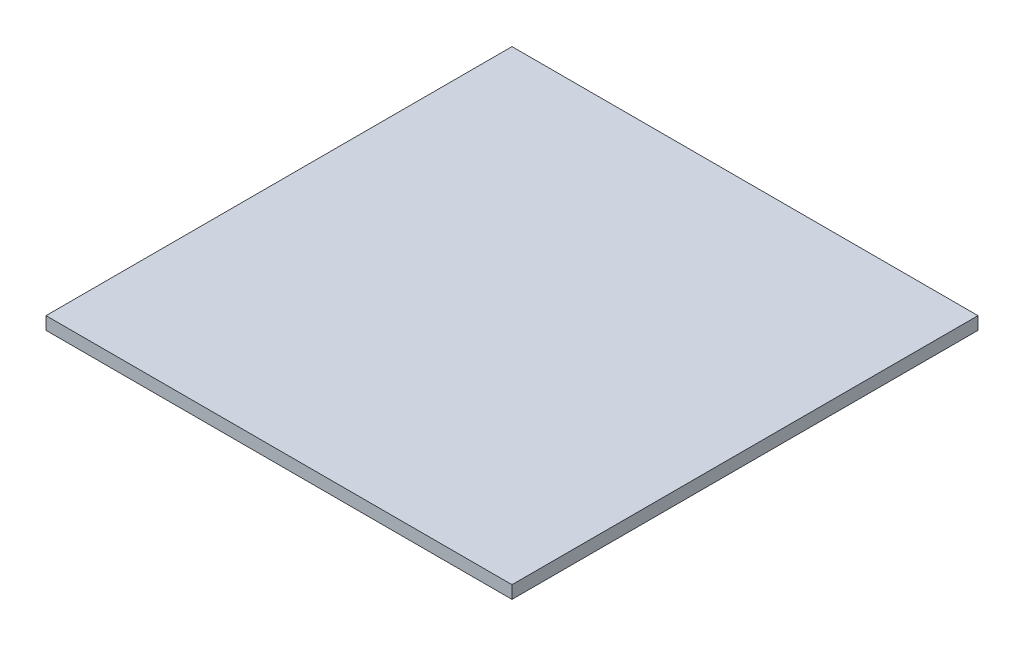
ISO-10303-21;
HEADER;
FILE_DESCRIPTION(('STEP AP214'),'2;1');
FILE_NAME('part.step','',(''),(''),'','','');
FILE_SCHEMA(('AUTOMOTIVE_DESIGN { 1 0 10303 214 1 1 1 1 }'));
ENDSEC;
DATA;
#1=APPLICATION_CONTEXT('core data for automotive mechanical design processes');
#2=APPLICATION_PROTOCOL_DEFINITION('international standard','automotive_design',2000,#1);
#3=PRODUCT_CONTEXT('',#1,'mechanical');
#4=PRODUCT('Part','Part','',(#3));
#5=PRODUCT_RELATED_PRODUCT_CATEGORY('part','',(#4));
#6=PRODUCT_DEFINITION_FORMATION('','',#4);
#7=PRODUCT_DEFINITION_CONTEXT('part definition',#1,'design');
#8=PRODUCT_DEFINITION('design','',#6,#7);
#9=PRODUCT_DEFINITION_SHAPE('','',#8);
#10=(LENGTH_UNIT() NAMED_UNIT(*) SI_UNIT(.MILLI.,.METRE.));
#11=(NAMED_UNIT(*) PLANE_ANGLE_UNIT() SI_UNIT($,.RADIAN.));
#12=(NAMED_UNIT(*) SI_UNIT($,.STERADIAN.) SOLID_ANGLE_UNIT());
#13=UNCERTAINTY_MEASURE_WITH_UNIT(LENGTH_MEASURE(1.E-05),#10,'distance_accuracy_value','');
#14=(GEOMETRIC_REPRESENTATION_CONTEXT(3) GLOBAL_UNCERTAINTY_ASSIGNED_CONTEXT((#13)) GLOBAL_UNIT_ASSIGNED_CONTEXT((#10,
#11,#12)) REPRESENTATION_CONTEXT('',''));
#15=CARTESIAN_POINT('',(0.,0.,0.));
#16=DIRECTION('',(0.,0.,1.));
#17=DIRECTION('',(1.,0.,0.));
#18=AXIS2_PLACEMENT_3D('',#15,#16,#17);
#19=CARTESIAN_POINT('',(-118.587048432742,2.2606,-65.1334894155714));
#20=DIRECTION('',(1.,0.,0.));
#21=DIRECTION('',(0.,0.,-1.));
#22=AXIS2_PLACEMENT_3D('',#19,#20,#21);
#23=PLANE('',#22);
#24=DIRECTION('',(0.,0.,1.));
#25=VECTOR('',#24,1.);
#26=CARTESIAN_POINT('',(-118.587048432742,0.,-65.1334894155714));
#27=LINE('',#26,#25);
#28=CARTESIAN_POINT('',(-118.587048432742,0.,-65.1334894155714));
#29=VERTEX_POINT('',#28);
#30=CARTESIAN_POINT('',(-118.587048432742,0.,17.4165105844286));
#31=VERTEX_POINT('',#30);
#32=EDGE_CURVE('E99',#29,#31,#27,.T.);
#33=ORIENTED_EDGE('',*,*,#32,.T.);
#34=DIRECTION('',(0.,-1.,0.));
#35=VECTOR('',#34,1.);
#36=CARTESIAN_POINT('',(-118.587048432742,2.2606,17.4165105844286));
#37=LINE('',#36,#35);
#38=CARTESIAN_POINT('',(-118.587048432742,2.2606,17.4165105844286));
#39=VERTEX_POINT('',#38);
#40=EDGE_CURVE('E11',#39,#31,#37,.T.);
#41=ORIENTED_EDGE('',*,*,#40,.F.);
#42=DIRECTION('',(0.,0.,1.));
#43=VECTOR('',#42,1.);
#44=CARTESIAN_POINT('',(-118.587048432742,2.2606,-65.1334894155714));
#45=LINE('',#44,#43);
#46=CARTESIAN_POINT('',(-118.587048432742,2.2606,-65.1334894155714));
#47=VERTEX_POINT('',#46);
#48=EDGE_CURVE('E87',#47,#39,#45,.T.);
#49=ORIENTED_EDGE('',*,*,#48,.F.);
#50=DIRECTION('',(0.,-1.,0.));
#51=VECTOR('',#50,1.);
#52=CARTESIAN_POINT('',(-118.587048432742,2.2606,-65.1334894155714));
#53=LINE('',#52,#51);
#54=EDGE_CURVE('E95',#47,#29,#53,.T.);
#55=ORIENTED_EDGE('',*,*,#54,.T.);
#56=EDGE_LOOP('',(#33,#41,#49,#55));
#57=FACE_BOUND('',#56,.T.);
#58=ADVANCED_FACE('F36',(#57),#23,.F.);
#59=CARTESIAN_POINT('',(-118.587048432742,2.2606,17.4165105844286));
#60=DIRECTION('',(0.,0.,-1.));
#61=DIRECTION('',(-1.,0.,0.));
#62=AXIS2_PLACEMENT_3D('',#59,#60,#61);
#63=PLANE('',#62);
#64=DIRECTION('',(1.,0.,0.));
#65=VECTOR('',#64,1.);
#66=CARTESIAN_POINT('',(-118.587048432742,0.,17.4165105844286));
#67=LINE('',#66,#65);
#68=CARTESIAN_POINT('',(-36.0370484327421,0.,17.4165105844286));
#69=VERTEX_POINT('',#68);
#70=EDGE_CURVE('E91',#31,#69,#67,.T.);
#71=ORIENTED_EDGE('',*,*,#70,.T.);
#72=DIRECTION('',(0.,-1.,0.));
#73=VECTOR('',#72,1.);
#74=CARTESIAN_POINT('',(-36.0370484327421,2.2606,17.4165105844286));
#75=LINE('',#74,#73);
#76=CARTESIAN_POINT('',(-36.0370484327421,2.2606,17.4165105844286));
#77=VERTEX_POINT('',#76);
#78=EDGE_CURVE('E44',#77,#69,#75,.T.);
#79=ORIENTED_EDGE('',*,*,#78,.F.);
#80=DIRECTION('',(1.,0.,0.));
#81=VECTOR('',#80,1.);
#82=CARTESIAN_POINT('',(-118.587048432742,2.2606,17.4165105844286));
#83=LINE('',#82,#81);
#84=EDGE_CURVE('E82',#39,#77,#83,.T.);
#85=ORIENTED_EDGE('',*,*,#84,.F.);
#86=ORIENTED_EDGE('',*,*,#40,.T.);
#87=EDGE_LOOP('',(#71,#79,#85,#86));
#88=FACE_BOUND('',#87,.T.);
#89=ADVANCED_FACE('F90',(#88),#63,.F.);
#90=CARTESIAN_POINT('',(-36.0370484327421,2.2606,-65.1334894155714));
#91=DIRECTION('',(-1.,0.,0.));
#92=DIRECTION('',(0.,0.,1.));
#93=AXIS2_PLACEMENT_3D('',#90,#91,#92);
#94=PLANE('',#93);
#95=DIRECTION('',(0.,0.,-1.));
#96=VECTOR('',#95,1.);
#97=CARTESIAN_POINT('',(-36.0370484327421,0.,-65.1334894155714));
#98=LINE('',#97,#96);
#99=CARTESIAN_POINT('',(-36.0370484327421,0.,-65.1334894155714));
#100=VERTEX_POINT('',#99);
#101=EDGE_CURVE('E69',#69,#100,#98,.T.);
#102=ORIENTED_EDGE('',*,*,#101,.T.);
#103=DIRECTION('',(0.,-1.,0.));
#104=VECTOR('',#103,1.);
#105=CARTESIAN_POINT('',(-36.0370484327421,2.2606,-65.1334894155714));
#106=LINE('',#105,#104);
#107=CARTESIAN_POINT('',(-36.0370484327421,2.2606,-65.1334894155714));
#108=VERTEX_POINT('',#107);
#109=EDGE_CURVE('E92',#108,#100,#106,.T.);
#110=ORIENTED_EDGE('',*,*,#109,.F.);
#111=DIRECTION('',(0.,0.,-1.));
#112=VECTOR('',#111,1.);
#113=CARTESIAN_POINT('',(-36.0370484327421,2.2606,-65.1334894155714));
#114=LINE('',#113,#112);
#115=EDGE_CURVE('E85',#77,#108,#114,.T.);
#116=ORIENTED_EDGE('',*,*,#115,.F.);
#117=ORIENTED_EDGE('',*,*,#78,.T.);
#118=EDGE_LOOP('',(#102,#110,#116,#117));
#119=FACE_BOUND('',#118,.T.);
#120=ADVANCED_FACE('F93',(#119),#94,.F.);
#121=CARTESIAN_POINT('',(-118.587048432742,2.2606,-65.1334894155714));
#122=DIRECTION('',(0.,0.,1.));
#123=DIRECTION('',(1.,0.,0.));
#124=AXIS2_PLACEMENT_3D('',#121,#122,#123);
#125=PLANE('',#124);
#126=DIRECTION('',(-1.,0.,0.));
#127=VECTOR('',#126,1.);
#128=CARTESIAN_POINT('',(-118.587048432742,0.,-65.1334894155714));
#129=LINE('',#128,#127);
#130=EDGE_CURVE('E75',#100,#29,#129,.T.);
#131=ORIENTED_EDGE('',*,*,#130,.T.);
#132=ORIENTED_EDGE('',*,*,#54,.F.);
#133=DIRECTION('',(-1.,0.,0.));
#134=VECTOR('',#133,1.);
#135=CARTESIAN_POINT('',(-118.587048432742,2.2606,-65.1334894155714));
#136=LINE('',#135,#134);
#137=EDGE_CURVE('E52',#108,#47,#136,.T.);
#138=ORIENTED_EDGE('',*,*,#137,.F.);
#139=ORIENTED_EDGE('',*,*,#109,.T.);
#140=EDGE_LOOP('',(#131,#132,#138,#139));
#141=FACE_BOUND('',#140,.T.);
#142=ADVANCED_FACE('F106',(#141),#125,.F.);
#143=CARTESIAN_POINT('',(0.,2.2606,0.));
#144=DIRECTION('',(0.,1.,0.));
#145=DIRECTION('',(0.,0.,1.));
#146=AXIS2_PLACEMENT_3D('',#143,#144,#145);
#147=PLANE('',#146);
#148=ORIENTED_EDGE('',*,*,#48,.T.);
#149=ORIENTED_EDGE('',*,*,#84,.T.);
#150=ORIENTED_EDGE('',*,*,#115,.T.);
#151=ORIENTED_EDGE('',*,*,#137,.T.);
#152=EDGE_LOOP('',(#148,#149,#150,#151));
#153=FACE_BOUND('',#152,.T.);
#154=ADVANCED_FACE('F83',(#153),#147,.T.);
#155=CARTESIAN_POINT('',(0.,0.,0.));
#156=DIRECTION('',(0.,1.,0.));
#157=DIRECTION('',(0.,0.,1.));
#158=AXIS2_PLACEMENT_3D('',#155,#156,#157);
#159=PLANE('',#158);
#160=ORIENTED_EDGE('',*,*,#32,.F.);
#161=ORIENTED_EDGE('',*,*,#130,.F.);
#162=ORIENTED_EDGE('',*,*,#101,.F.);
#163=ORIENTED_EDGE('',*,*,#70,.F.);
#164=EDGE_LOOP('',(#160,#161,#162,#163));
#165=FACE_BOUND('',#164,.T.);
#166=ADVANCED_FACE('F109',(#165),#159,.F.);
#167=CLOSED_SHELL('',(#58,#89,#120,#142,#154,#166));
#168=MANIFOLD_SOLID_BREP('B2',#167);
#169=ADVANCED_BREP_SHAPE_REPRESENTATION('',(#18,#168),#14);
#170=SHAPE_DEFINITION_REPRESENTATION(#9,#169);
ENDSEC;
END-ISO-10303-21;
